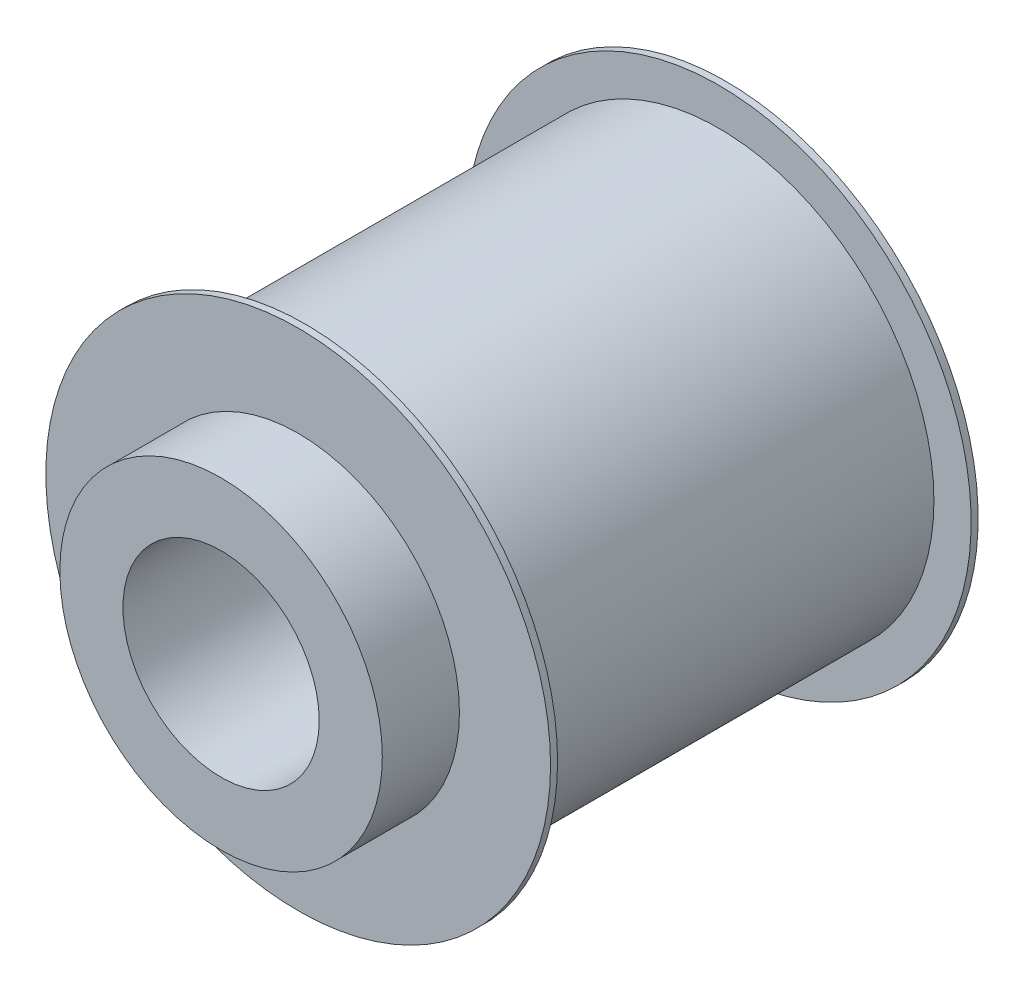
ISO-10303-21;
HEADER;
FILE_DESCRIPTION(('STEP AP214'),'2;1');
FILE_NAME('part.step','',(''),(''),'','','');
FILE_SCHEMA(('AUTOMOTIVE_DESIGN { 1 0 10303 214 1 1 1 1 }'));
ENDSEC;
DATA;
#1=APPLICATION_CONTEXT('core data for automotive mechanical design processes');
#2=APPLICATION_PROTOCOL_DEFINITION('international standard','automotive_design',2000,#1);
#3=PRODUCT_CONTEXT('',#1,'mechanical');
#4=PRODUCT('Part','Part','',(#3));
#5=PRODUCT_RELATED_PRODUCT_CATEGORY('part','',(#4));
#6=PRODUCT_DEFINITION_FORMATION('','',#4);
#7=PRODUCT_DEFINITION_CONTEXT('part definition',#1,'design');
#8=PRODUCT_DEFINITION('design','',#6,#7);
#9=PRODUCT_DEFINITION_SHAPE('','',#8);
#10=(LENGTH_UNIT() NAMED_UNIT(*) SI_UNIT(.MILLI.,.METRE.));
#11=(NAMED_UNIT(*) PLANE_ANGLE_UNIT() SI_UNIT($,.RADIAN.));
#12=(NAMED_UNIT(*) SI_UNIT($,.STERADIAN.) SOLID_ANGLE_UNIT());
#13=UNCERTAINTY_MEASURE_WITH_UNIT(LENGTH_MEASURE(1.E-05),#10,'distance_accuracy_value','');
#14=(GEOMETRIC_REPRESENTATION_CONTEXT(3) GLOBAL_UNCERTAINTY_ASSIGNED_CONTEXT((#13)) GLOBAL_UNIT_ASSIGNED_CONTEXT((#10,
#11,#12)) REPRESENTATION_CONTEXT('',''));
#15=CARTESIAN_POINT('',(0.,0.,0.));
#16=DIRECTION('',(0.,0.,1.));
#17=DIRECTION('',(1.,0.,0.));
#18=AXIS2_PLACEMENT_3D('',#15,#16,#17);
#19=CARTESIAN_POINT('',(0.,0.,30.5));
#20=DIRECTION('',(0.,0.,-1.));
#21=DIRECTION('',(-1.,0.,0.));
#22=AXIS2_PLACEMENT_3D('',#19,#20,#21);
#23=CYLINDRICAL_SURFACE('',#22,15.345);
#24=CARTESIAN_POINT('',(0.,0.,30.));
#25=DIRECTION('',(0.,0.,1.));
#26=DIRECTION('',(1.,0.,0.));
#27=AXIS2_PLACEMENT_3D('',#24,#25,#26);
#28=CIRCLE('',#27,15.345);
#29=CARTESIAN_POINT('',(15.345,0.,30.));
#30=VERTEX_POINT('',#29);
#31=EDGE_CURVE('E37',#30,#30,#28,.T.);
#32=ORIENTED_EDGE('',*,*,#31,.F.);
#33=EDGE_LOOP('',(#32));
#34=FACE_BOUND('',#33,.T.);
#35=CARTESIAN_POINT('',(0.,0.,0.5));
#36=DIRECTION('',(0.,0.,-1.));
#37=DIRECTION('',(-1.,0.,0.));
#38=AXIS2_PLACEMENT_3D('',#35,#36,#37);
#39=CIRCLE('',#38,15.345);
#40=CARTESIAN_POINT('',(-15.345,0.,0.5));
#41=VERTEX_POINT('',#40);
#42=EDGE_CURVE('E10',#41,#41,#39,.T.);
#43=ORIENTED_EDGE('',*,*,#42,.F.);
#44=EDGE_LOOP('',(#43));
#45=FACE_BOUND('',#44,.T.);
#46=ADVANCED_FACE('F31',(#34,#45),#23,.T.);
#47=CARTESIAN_POINT('',(0.,0.,30.5));
#48=DIRECTION('',(0.,0.,1.));
#49=DIRECTION('',(1.,0.,0.));
#50=AXIS2_PLACEMENT_3D('',#47,#48,#49);
#51=PLANE('',#50);
#52=CARTESIAN_POINT('',(0.,0.,30.5));
#53=DIRECTION('',(0.,0.,1.));
#54=DIRECTION('',(1.,0.,0.));
#55=AXIS2_PLACEMENT_3D('',#52,#53,#54);
#56=CIRCLE('',#55,11.5);
#57=CARTESIAN_POINT('',(11.5,0.,30.5));
#58=VERTEX_POINT('',#57);
#59=EDGE_CURVE('E41',#58,#58,#56,.T.);
#60=ORIENTED_EDGE('',*,*,#59,.F.);
#61=EDGE_LOOP('',(#60));
#62=FACE_BOUND('',#61,.T.);
#63=CARTESIAN_POINT('',(0.,0.,30.5));
#64=DIRECTION('',(0.,0.,1.));
#65=DIRECTION('',(1.,0.,0.));
#66=AXIS2_PLACEMENT_3D('',#63,#64,#65);
#67=CIRCLE('',#66,18.);
#68=CARTESIAN_POINT('',(18.,0.,30.5));
#69=VERTEX_POINT('',#68);
#70=EDGE_CURVE('E51',#69,#69,#67,.T.);
#71=ORIENTED_EDGE('',*,*,#70,.T.);
#72=EDGE_LOOP('',(#71));
#73=FACE_BOUND('',#72,.T.);
#74=ADVANCED_FACE('F88',(#62,#73),#51,.T.);
#75=CARTESIAN_POINT('',(0.,0.,36.));
#76=DIRECTION('',(0.,0.,-1.));
#77=DIRECTION('',(-1.,0.,0.));
#78=AXIS2_PLACEMENT_3D('',#75,#76,#77);
#79=CYLINDRICAL_SURFACE('',#78,11.5);
#80=CARTESIAN_POINT('',(0.,0.,36.));
#81=DIRECTION('',(0.,0.,1.));
#82=DIRECTION('',(1.,0.,0.));
#83=AXIS2_PLACEMENT_3D('',#80,#81,#82);
#84=CIRCLE('',#83,11.5);
#85=CARTESIAN_POINT('',(11.5,0.,36.));
#86=VERTEX_POINT('',#85);
#87=EDGE_CURVE('E45',#86,#86,#84,.T.);
#88=ORIENTED_EDGE('',*,*,#87,.F.);
#89=EDGE_LOOP('',(#88));
#90=FACE_BOUND('',#89,.T.);
#91=ORIENTED_EDGE('',*,*,#59,.T.);
#92=EDGE_LOOP('',(#91));
#93=FACE_BOUND('',#92,.T.);
#94=ADVANCED_FACE('F82',(#90,#93),#79,.T.);
#95=CARTESIAN_POINT('',(0.,0.,36.));
#96=DIRECTION('',(0.,0.,1.));
#97=DIRECTION('',(1.,0.,0.));
#98=AXIS2_PLACEMENT_3D('',#95,#96,#97);
#99=PLANE('',#98);
#100=CARTESIAN_POINT('',(0.,0.,36.));
#101=DIRECTION('',(0.,0.,1.));
#102=DIRECTION('',(1.,0.,0.));
#103=AXIS2_PLACEMENT_3D('',#100,#101,#102);
#104=CIRCLE('',#103,7.);
#105=CARTESIAN_POINT('',(7.,0.,36.));
#106=VERTEX_POINT('',#105);
#107=EDGE_CURVE('E63',#106,#106,#104,.T.);
#108=ORIENTED_EDGE('',*,*,#107,.F.);
#109=EDGE_LOOP('',(#108));
#110=FACE_BOUND('',#109,.T.);
#111=ORIENTED_EDGE('',*,*,#87,.T.);
#112=EDGE_LOOP('',(#111));
#113=FACE_BOUND('',#112,.T.);
#114=ADVANCED_FACE('F78',(#110,#113),#99,.T.);
#115=CARTESIAN_POINT('',(0.,0.,30.));
#116=DIRECTION('',(0.,0.,1.));
#117=DIRECTION('',(1.,0.,0.));
#118=AXIS2_PLACEMENT_3D('',#115,#116,#117);
#119=CYLINDRICAL_SURFACE('',#118,18.);
#120=CARTESIAN_POINT('',(0.,0.,30.));
#121=DIRECTION('',(0.,0.,1.));
#122=DIRECTION('',(1.,0.,0.));
#123=AXIS2_PLACEMENT_3D('',#120,#121,#122);
#124=CIRCLE('',#123,18.);
#125=CARTESIAN_POINT('',(18.,0.,30.));
#126=VERTEX_POINT('',#125);
#127=EDGE_CURVE('E50',#126,#126,#124,.T.);
#128=ORIENTED_EDGE('',*,*,#127,.T.);
#129=EDGE_LOOP('',(#128));
#130=FACE_BOUND('',#129,.T.);
#131=ORIENTED_EDGE('',*,*,#70,.F.);
#132=EDGE_LOOP('',(#131));
#133=FACE_BOUND('',#132,.T.);
#134=ADVANCED_FACE('F81',(#130,#133),#119,.T.);
#135=CARTESIAN_POINT('',(0.,0.,30.));
#136=DIRECTION('',(0.,0.,1.));
#137=DIRECTION('',(1.,0.,0.));
#138=AXIS2_PLACEMENT_3D('',#135,#136,#137);
#139=PLANE('',#138);
#140=ORIENTED_EDGE('',*,*,#31,.T.);
#141=EDGE_LOOP('',(#140));
#142=FACE_BOUND('',#141,.T.);
#143=ORIENTED_EDGE('',*,*,#127,.F.);
#144=EDGE_LOOP('',(#143));
#145=FACE_BOUND('',#144,.T.);
#146=ADVANCED_FACE('F98',(#142,#145),#139,.F.);
#147=CARTESIAN_POINT('',(0.,0.,0.5));
#148=DIRECTION('',(0.,0.,-1.));
#149=DIRECTION('',(-1.,0.,0.));
#150=AXIS2_PLACEMENT_3D('',#147,#148,#149);
#151=CYLINDRICAL_SURFACE('',#150,18.);
#152=CARTESIAN_POINT('',(0.,0.,0.5));
#153=DIRECTION('',(0.,0.,-1.));
#154=DIRECTION('',(-1.,0.,0.));
#155=AXIS2_PLACEMENT_3D('',#152,#153,#154);
#156=CIRCLE('',#155,18.);
#157=CARTESIAN_POINT('',(-18.,0.,0.5));
#158=VERTEX_POINT('',#157);
#159=EDGE_CURVE('E54',#158,#158,#156,.T.);
#160=ORIENTED_EDGE('',*,*,#159,.T.);
#161=EDGE_LOOP('',(#160));
#162=FACE_BOUND('',#161,.T.);
#163=CARTESIAN_POINT('',(0.,0.,0.));
#164=DIRECTION('',(0.,0.,-1.));
#165=DIRECTION('',(-1.,0.,0.));
#166=AXIS2_PLACEMENT_3D('',#163,#164,#165);
#167=CIRCLE('',#166,18.);
#168=CARTESIAN_POINT('',(-18.,0.,0.));
#169=VERTEX_POINT('',#168);
#170=EDGE_CURVE('E57',#169,#169,#167,.T.);
#171=ORIENTED_EDGE('',*,*,#170,.F.);
#172=EDGE_LOOP('',(#171));
#173=FACE_BOUND('',#172,.T.);
#174=ADVANCED_FACE('F104',(#162,#173),#151,.T.);
#175=CARTESIAN_POINT('',(0.,0.,0.5));
#176=DIRECTION('',(0.,0.,-1.));
#177=DIRECTION('',(-1.,0.,0.));
#178=AXIS2_PLACEMENT_3D('',#175,#176,#177);
#179=PLANE('',#178);
#180=ORIENTED_EDGE('',*,*,#42,.T.);
#181=EDGE_LOOP('',(#180));
#182=FACE_BOUND('',#181,.T.);
#183=ORIENTED_EDGE('',*,*,#159,.F.);
#184=EDGE_LOOP('',(#183));
#185=FACE_BOUND('',#184,.T.);
#186=ADVANCED_FACE('F131',(#182,#185),#179,.F.);
#187=CARTESIAN_POINT('',(0.,0.,0.));
#188=DIRECTION('',(0.,0.,1.));
#189=DIRECTION('',(1.,0.,0.));
#190=AXIS2_PLACEMENT_3D('',#187,#188,#189);
#191=PLANE('',#190);
#192=CARTESIAN_POINT('',(0.,0.,0.));
#193=DIRECTION('',(0.,0.,1.));
#194=DIRECTION('',(1.,0.,0.));
#195=AXIS2_PLACEMENT_3D('',#192,#193,#194);
#196=CIRCLE('',#195,7.);
#197=CARTESIAN_POINT('',(7.,0.,0.));
#198=VERTEX_POINT('',#197);
#199=EDGE_CURVE('E60',#198,#198,#196,.T.);
#200=ORIENTED_EDGE('',*,*,#199,.T.);
#201=EDGE_LOOP('',(#200));
#202=FACE_BOUND('',#201,.T.);
#203=ORIENTED_EDGE('',*,*,#170,.T.);
#204=EDGE_LOOP('',(#203));
#205=FACE_BOUND('',#204,.T.);
#206=ADVANCED_FACE('F69',(#202,#205),#191,.F.);
#207=CARTESIAN_POINT('',(0.,0.,0.));
#208=DIRECTION('',(0.,0.,1.));
#209=DIRECTION('',(1.,0.,0.));
#210=AXIS2_PLACEMENT_3D('',#207,#208,#209);
#211=CYLINDRICAL_SURFACE('',#210,7.);
#212=ORIENTED_EDGE('',*,*,#199,.F.);
#213=EDGE_LOOP('',(#212));
#214=FACE_BOUND('',#213,.T.);
#215=ORIENTED_EDGE('',*,*,#107,.T.);
#216=EDGE_LOOP('',(#215));
#217=FACE_BOUND('',#216,.T.);
#218=ADVANCED_FACE('F72',(#214,#217),#211,.F.);
#219=CLOSED_SHELL('',(#46,#74,#94,#114,#134,#146,#174,#186,#206,#218));
#220=MANIFOLD_SOLID_BREP('B2',#219);
#221=ADVANCED_BREP_SHAPE_REPRESENTATION('',(#18,#220),#14);
#222=SHAPE_DEFINITION_REPRESENTATION(#9,#221);
ENDSEC;
END-ISO-10303-21;
